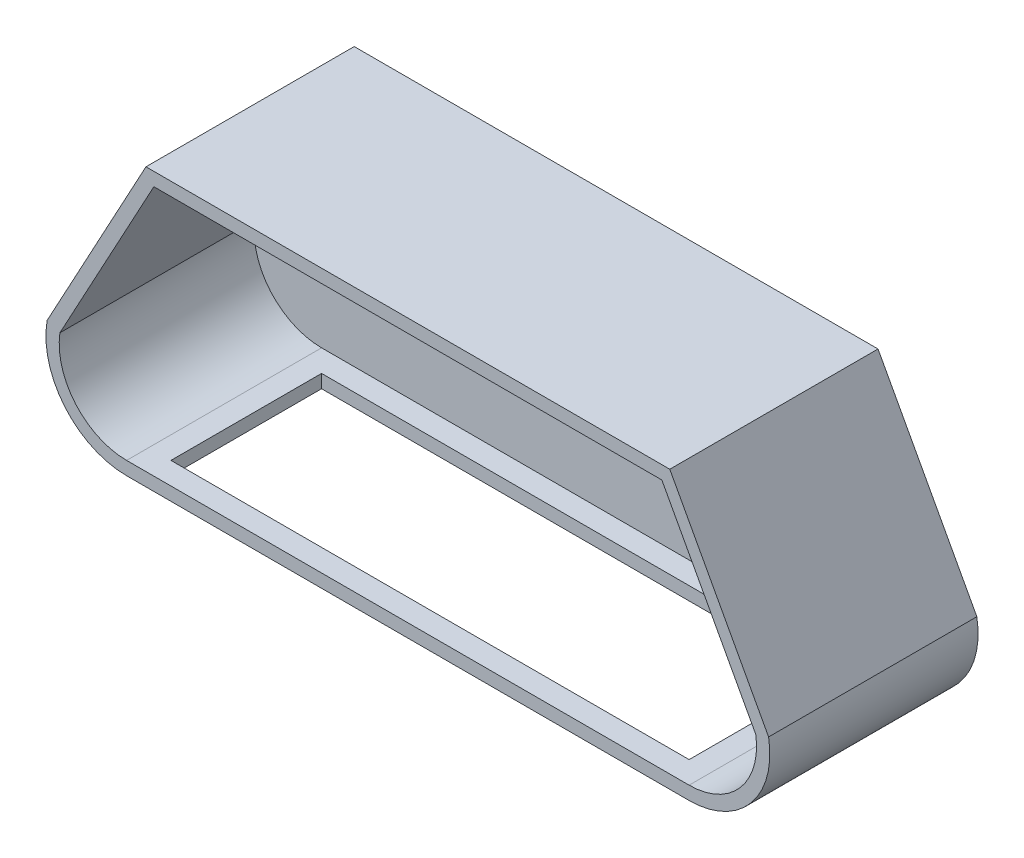
ISO-10303-21;
HEADER;
FILE_DESCRIPTION(('STEP AP214'),'2;1');
FILE_NAME('part.step','',(''),(''),'','','');
FILE_SCHEMA(('AUTOMOTIVE_DESIGN { 1 0 10303 214 1 1 1 1 }'));
ENDSEC;
DATA;
#1=APPLICATION_CONTEXT('core data for automotive mechanical design processes');
#2=APPLICATION_PROTOCOL_DEFINITION('international standard','automotive_design',2000,#1);
#3=PRODUCT_CONTEXT('',#1,'mechanical');
#4=PRODUCT('Part','Part','',(#3));
#5=PRODUCT_RELATED_PRODUCT_CATEGORY('part','',(#4));
#6=PRODUCT_DEFINITION_FORMATION('','',#4);
#7=PRODUCT_DEFINITION_CONTEXT('part definition',#1,'design');
#8=PRODUCT_DEFINITION('design','',#6,#7);
#9=PRODUCT_DEFINITION_SHAPE('','',#8);
#10=(LENGTH_UNIT() NAMED_UNIT(*) SI_UNIT(.MILLI.,.METRE.));
#11=(NAMED_UNIT(*) PLANE_ANGLE_UNIT() SI_UNIT($,.RADIAN.));
#12=(NAMED_UNIT(*) SI_UNIT($,.STERADIAN.) SOLID_ANGLE_UNIT());
#13=UNCERTAINTY_MEASURE_WITH_UNIT(LENGTH_MEASURE(1.E-05),#10,'distance_accuracy_value','');
#14=(GEOMETRIC_REPRESENTATION_CONTEXT(3) GLOBAL_UNCERTAINTY_ASSIGNED_CONTEXT((#13)) GLOBAL_UNIT_ASSIGNED_CONTEXT((#10,
#11,#12)) REPRESENTATION_CONTEXT('',''));
#15=CARTESIAN_POINT('',(0.,0.,0.));
#16=DIRECTION('',(0.,0.,1.));
#17=DIRECTION('',(1.,0.,0.));
#18=AXIS2_PLACEMENT_3D('',#15,#16,#17);
#19=CARTESIAN_POINT('',(0.,-61.,88.));
#20=DIRECTION('',(0.,-1.,0.));
#21=DIRECTION('',(1.,0.,0.));
#22=AXIS2_PLACEMENT_3D('',#19,#20,#21);
#23=PLANE('',#22);
#24=DIRECTION('',(0.,0.,-1.));
#25=VECTOR('',#24,1.);
#26=CARTESIAN_POINT('',(116.949501519958,-61.,0.));
#27=LINE('',#26,#25);
#28=CARTESIAN_POINT('',(116.949501519958,-61.,78.));
#29=VERTEX_POINT('',#28);
#30=CARTESIAN_POINT('',(116.949501519958,-61.,10.));
#31=VERTEX_POINT('',#30);
#32=EDGE_CURVE('E187',#29,#31,#27,.T.);
#33=ORIENTED_EDGE('',*,*,#32,.T.);
#34=DIRECTION('',(1.,0.,0.));
#35=VECTOR('',#34,1.);
#36=CARTESIAN_POINT('',(0.,-61.,10.));
#37=LINE('',#36,#35);
#38=CARTESIAN_POINT('',(-116.949501519958,-61.,10.));
#39=VERTEX_POINT('',#38);
#40=EDGE_CURVE('E191',#39,#31,#37,.T.);
#41=ORIENTED_EDGE('',*,*,#40,.F.);
#42=DIRECTION('',(0.,0.,-1.));
#43=VECTOR('',#42,1.);
#44=CARTESIAN_POINT('',(-116.949501519958,-61.,0.));
#45=LINE('',#44,#43);
#46=CARTESIAN_POINT('',(-116.949501519958,-61.,78.));
#47=VERTEX_POINT('',#46);
#48=EDGE_CURVE('E186',#47,#39,#45,.T.);
#49=ORIENTED_EDGE('',*,*,#48,.F.);
#50=DIRECTION('',(1.,0.,0.));
#51=VECTOR('',#50,1.);
#52=CARTESIAN_POINT('',(0.,-61.,78.));
#53=LINE('',#52,#51);
#54=EDGE_CURVE('E192',#47,#29,#53,.T.);
#55=ORIENTED_EDGE('',*,*,#54,.T.);
#56=EDGE_LOOP('',(#33,#41,#49,#55));
#57=FACE_BOUND('',#56,.T.);
#58=DIRECTION('',(0.,0.,-1.));
#59=VECTOR('',#58,1.);
#60=CARTESIAN_POINT('',(-126.949501519958,-61.,88.));
#61=LINE('',#60,#59);
#62=CARTESIAN_POINT('',(-126.949501519958,-61.,88.));
#63=VERTEX_POINT('',#62);
#64=CARTESIAN_POINT('',(-126.949501519958,-61.,-6.));
#65=VERTEX_POINT('',#64);
#66=EDGE_CURVE('E165',#63,#65,#61,.T.);
#67=ORIENTED_EDGE('',*,*,#66,.T.);
#68=DIRECTION('',(-1.,0.,0.));
#69=VECTOR('',#68,1.);
#70=CARTESIAN_POINT('',(0.,-61.,-6.));
#71=LINE('',#70,#69);
#72=CARTESIAN_POINT('',(126.949501519958,-61.,-6.));
#73=VERTEX_POINT('',#72);
#74=EDGE_CURVE('E164',#73,#65,#71,.T.);
#75=ORIENTED_EDGE('',*,*,#74,.F.);
#76=DIRECTION('',(0.,0.,-1.));
#77=VECTOR('',#76,1.);
#78=CARTESIAN_POINT('',(126.949501519958,-61.,88.));
#79=LINE('',#78,#77);
#80=CARTESIAN_POINT('',(126.949501519958,-61.,88.));
#81=VERTEX_POINT('',#80);
#82=EDGE_CURVE('E149',#81,#73,#79,.T.);
#83=ORIENTED_EDGE('',*,*,#82,.F.);
#84=DIRECTION('',(-1.,0.,0.));
#85=VECTOR('',#84,1.);
#86=CARTESIAN_POINT('',(0.,-61.,88.));
#87=LINE('',#86,#85);
#88=EDGE_CURVE('E221',#81,#63,#87,.T.);
#89=ORIENTED_EDGE('',*,*,#88,.T.);
#90=EDGE_LOOP('',(#67,#75,#83,#89));
#91=FACE_BOUND('',#90,.T.);
#92=ADVANCED_FACE('F37',(#57,#91),#23,.T.);
#93=CARTESIAN_POINT('',(126.949501519958,-24.5687329178451,88.));
#94=DIRECTION('',(0.,0.,-1.));
#95=DIRECTION('',(-1.,0.,0.));
#96=AXIS2_PLACEMENT_3D('',#93,#94,#95);
#97=CYLINDRICAL_SURFACE('',#96,36.4312670821549);
#98=ORIENTED_EDGE('',*,*,#82,.T.);
#99=CARTESIAN_POINT('',(126.949501519958,-24.5687329178451,-6.));
#100=DIRECTION('',(0.,0.,1.));
#101=DIRECTION('',(1.,0.,0.));
#102=AXIS2_PLACEMENT_3D('',#99,#100,#101);
#103=CIRCLE('',#102,36.4312670821549);
#104=CARTESIAN_POINT('',(162.822637658857,-18.2161488159757,-6.));
#105=VERTEX_POINT('',#104);
#106=EDGE_CURVE('E154',#73,#105,#103,.T.);
#107=ORIENTED_EDGE('',*,*,#106,.T.);
#108=DIRECTION('',(0.,0.,-1.));
#109=VECTOR('',#108,1.);
#110=CARTESIAN_POINT('',(162.822637658857,-18.2161488159757,88.));
#111=LINE('',#110,#109);
#112=CARTESIAN_POINT('',(162.822637658857,-18.2161488159757,88.));
#113=VERTEX_POINT('',#112);
#114=EDGE_CURVE('E161',#113,#105,#111,.T.);
#115=ORIENTED_EDGE('',*,*,#114,.F.);
#116=CARTESIAN_POINT('',(126.949501519958,-24.5687329178451,88.));
#117=DIRECTION('',(0.,0.,1.));
#118=DIRECTION('',(1.,0.,0.));
#119=AXIS2_PLACEMENT_3D('',#116,#117,#118);
#120=CIRCLE('',#119,36.4312670821549);
#121=EDGE_CURVE('E156',#81,#113,#120,.T.);
#122=ORIENTED_EDGE('',*,*,#121,.F.);
#123=EDGE_LOOP('',(#98,#107,#115,#122));
#124=FACE_BOUND('',#123,.T.);
#125=ADVANCED_FACE('F151',(#124),#97,.T.);
#126=CARTESIAN_POINT('',(118.258256189151,64.05655543579,88.));
#127=DIRECTION('',(-0.879291966536774,-0.476283148540753,0.));
#128=DIRECTION('',(0.476283148540753,-0.879291966536774,0.));
#129=AXIS2_PLACEMENT_3D('',#126,#127,#128);
#130=PLANE('',#129);
#131=ORIENTED_EDGE('',*,*,#114,.T.);
#132=DIRECTION('',(-0.476283148540752,0.879291966536774,0.));
#133=VECTOR('',#132,1.);
#134=CARTESIAN_POINT('',(118.258256189151,64.05655543579,-6.));
#135=LINE('',#134,#133);
#136=CARTESIAN_POINT('',(118.214818276398,64.1367485054865,-6.));
#137=VERTEX_POINT('',#136);
#138=EDGE_CURVE('E174',#105,#137,#135,.T.);
#139=ORIENTED_EDGE('',*,*,#138,.T.);
#140=DIRECTION('',(0.,0.,-1.));
#141=VECTOR('',#140,1.);
#142=CARTESIAN_POINT('',(118.214818276398,64.1367485054865,88.));
#143=LINE('',#142,#141);
#144=CARTESIAN_POINT('',(118.214818276398,64.1367485054865,88.));
#145=VERTEX_POINT('',#144);
#146=EDGE_CURVE('E255',#145,#137,#143,.T.);
#147=ORIENTED_EDGE('',*,*,#146,.F.);
#148=DIRECTION('',(-0.476283148540752,0.879291966536774,0.));
#149=VECTOR('',#148,1.);
#150=CARTESIAN_POINT('',(118.258256189151,64.05655543579,88.));
#151=LINE('',#150,#149);
#152=EDGE_CURVE('E224',#113,#145,#151,.T.);
#153=ORIENTED_EDGE('',*,*,#152,.F.);
#154=EDGE_LOOP('',(#131,#139,#147,#153));
#155=FACE_BOUND('',#154,.T.);
#156=ADVANCED_FACE('F299',(#155),#130,.F.);
#157=CARTESIAN_POINT('',(0.,64.1367485054865,88.));
#158=DIRECTION('',(0.,-1.,0.));
#159=DIRECTION('',(0.,0.,-1.));
#160=AXIS2_PLACEMENT_3D('',#157,#158,#159);
#161=PLANE('',#160);
#162=ORIENTED_EDGE('',*,*,#146,.T.);
#163=DIRECTION('',(-1.,0.,0.));
#164=VECTOR('',#163,1.);
#165=CARTESIAN_POINT('',(0.,64.1367485054865,-6.));
#166=LINE('',#165,#164);
#167=CARTESIAN_POINT('',(-118.214818276398,64.1367485054865,-6.));
#168=VERTEX_POINT('',#167);
#169=EDGE_CURVE('E176',#137,#168,#166,.T.);
#170=ORIENTED_EDGE('',*,*,#169,.T.);
#171=DIRECTION('',(0.,0.,-1.));
#172=VECTOR('',#171,1.);
#173=CARTESIAN_POINT('',(-118.214818276398,64.1367485054865,88.));
#174=LINE('',#173,#172);
#175=CARTESIAN_POINT('',(-118.214818276398,64.1367485054865,88.));
#176=VERTEX_POINT('',#175);
#177=EDGE_CURVE('E253',#176,#168,#174,.T.);
#178=ORIENTED_EDGE('',*,*,#177,.F.);
#179=DIRECTION('',(-1.,0.,0.));
#180=VECTOR('',#179,1.);
#181=CARTESIAN_POINT('',(0.,64.1367485054865,88.));
#182=LINE('',#181,#180);
#183=EDGE_CURVE('E227',#145,#176,#182,.T.);
#184=ORIENTED_EDGE('',*,*,#183,.F.);
#185=EDGE_LOOP('',(#162,#170,#178,#184));
#186=FACE_BOUND('',#185,.T.);
#187=ADVANCED_FACE('F328',(#186),#161,.F.);
#188=CARTESIAN_POINT('',(-118.258256189151,64.0565554357899,88.));
#189=DIRECTION('',(-0.879291966536774,0.476283148540752,0.));
#190=DIRECTION('',(-0.476283148540752,-0.879291966536774,0.));
#191=AXIS2_PLACEMENT_3D('',#188,#189,#190);
#192=PLANE('',#191);
#193=ORIENTED_EDGE('',*,*,#177,.T.);
#194=DIRECTION('',(0.476283148540752,0.879291966536774,0.));
#195=VECTOR('',#194,1.);
#196=CARTESIAN_POINT('',(-118.258256189151,64.0565554357899,-6.));
#197=LINE('',#196,#195);
#198=CARTESIAN_POINT('',(-162.822637658857,-18.2161488159757,-6.));
#199=VERTEX_POINT('',#198);
#200=EDGE_CURVE('E181',#199,#168,#197,.T.);
#201=ORIENTED_EDGE('',*,*,#200,.F.);
#202=DIRECTION('',(0.,0.,-1.));
#203=VECTOR('',#202,1.);
#204=CARTESIAN_POINT('',(-162.822637658857,-18.2161488159757,88.));
#205=LINE('',#204,#203);
#206=CARTESIAN_POINT('',(-162.822637658857,-18.2161488159757,88.));
#207=VERTEX_POINT('',#206);
#208=EDGE_CURVE('E250',#207,#199,#205,.T.);
#209=ORIENTED_EDGE('',*,*,#208,.F.);
#210=DIRECTION('',(0.476283148540752,0.879291966536774,0.));
#211=VECTOR('',#210,1.);
#212=CARTESIAN_POINT('',(-118.258256189151,64.0565554357899,88.));
#213=LINE('',#212,#211);
#214=EDGE_CURVE('E229',#207,#176,#213,.T.);
#215=ORIENTED_EDGE('',*,*,#214,.T.);
#216=EDGE_LOOP('',(#193,#201,#209,#215));
#217=FACE_BOUND('',#216,.T.);
#218=ADVANCED_FACE('F323',(#217),#192,.T.);
#219=CARTESIAN_POINT('',(126.949501519958,-24.5687329178451,88.));
#220=DIRECTION('',(0.,0.,-1.));
#221=DIRECTION('',(-1.,0.,0.));
#222=AXIS2_PLACEMENT_3D('',#219,#220,#221);
#223=CYLINDRICAL_SURFACE('',#222,30.4312670821549);
#224=CARTESIAN_POINT('',(126.949501519958,-24.5687329178451,0.));
#225=DIRECTION('',(0.,0.,1.));
#226=DIRECTION('',(1.,0.,0.));
#227=AXIS2_PLACEMENT_3D('',#224,#225,#226);
#228=CIRCLE('',#227,30.4312670821549);
#229=CARTESIAN_POINT('',(126.949501519958,-55.,0.));
#230=VERTEX_POINT('',#229);
#231=CARTESIAN_POINT('',(157.062609578427,-20.1797991880649,0.));
#232=VERTEX_POINT('',#231);
#233=EDGE_CURVE('E204',#230,#232,#228,.T.);
#234=ORIENTED_EDGE('',*,*,#233,.F.);
#235=DIRECTION('',(0.,0.,-1.));
#236=VECTOR('',#235,1.);
#237=CARTESIAN_POINT('',(126.949501519958,-55.,88.));
#238=LINE('',#237,#236);
#239=CARTESIAN_POINT('',(126.949501519958,-55.,88.));
#240=VERTEX_POINT('',#239);
#241=EDGE_CURVE('E251',#240,#230,#238,.T.);
#242=ORIENTED_EDGE('',*,*,#241,.F.);
#243=CARTESIAN_POINT('',(126.949501519958,-24.5687329178451,88.));
#244=DIRECTION('',(0.,0.,1.));
#245=DIRECTION('',(1.,0.,0.));
#246=AXIS2_PLACEMENT_3D('',#243,#244,#245);
#247=CIRCLE('',#246,30.4312670821549);
#248=CARTESIAN_POINT('',(157.062609578427,-20.1797991880649,88.));
#249=VERTEX_POINT('',#248);
#250=EDGE_CURVE('E205',#240,#249,#247,.T.);
#251=ORIENTED_EDGE('',*,*,#250,.T.);
#252=DIRECTION('',(0.,0.,-1.));
#253=VECTOR('',#252,1.);
#254=CARTESIAN_POINT('',(157.062609578427,-20.1797991880649,88.));
#255=LINE('',#254,#253);
#256=EDGE_CURVE('E235',#249,#232,#255,.T.);
#257=ORIENTED_EDGE('',*,*,#256,.T.);
#258=EDGE_LOOP('',(#234,#242,#251,#257));
#259=FACE_BOUND('',#258,.T.);
#260=ADVANCED_FACE('F39',(#259),#223,.F.);
#261=CARTESIAN_POINT('',(0.,-55.,88.));
#262=DIRECTION('',(0.,-1.,0.));
#263=DIRECTION('',(1.,0.,0.));
#264=AXIS2_PLACEMENT_3D('',#261,#262,#263);
#265=PLANE('',#264);
#266=DIRECTION('',(-1.,0.,0.));
#267=VECTOR('',#266,1.);
#268=CARTESIAN_POINT('',(0.,-55.,9.99999999999999));
#269=LINE('',#268,#267);
#270=CARTESIAN_POINT('',(116.949501519958,-55.,10.));
#271=VERTEX_POINT('',#270);
#272=CARTESIAN_POINT('',(-116.949501519958,-55.,9.99999999999999));
#273=VERTEX_POINT('',#272);
#274=EDGE_CURVE('E45',#271,#273,#269,.T.);
#275=ORIENTED_EDGE('',*,*,#274,.F.);
#276=DIRECTION('',(0.,0.,1.));
#277=VECTOR('',#276,1.);
#278=CARTESIAN_POINT('',(116.949501519958,-55.,88.));
#279=LINE('',#278,#277);
#280=CARTESIAN_POINT('',(116.949501519958,-55.,78.));
#281=VERTEX_POINT('',#280);
#282=EDGE_CURVE('E11',#271,#281,#279,.T.);
#283=ORIENTED_EDGE('',*,*,#282,.T.);
#284=DIRECTION('',(-1.,0.,0.));
#285=VECTOR('',#284,1.);
#286=CARTESIAN_POINT('',(0.,-55.,78.));
#287=LINE('',#286,#285);
#288=CARTESIAN_POINT('',(-116.949501519958,-55.,78.));
#289=VERTEX_POINT('',#288);
#290=EDGE_CURVE('E160',#281,#289,#287,.T.);
#291=ORIENTED_EDGE('',*,*,#290,.T.);
#292=DIRECTION('',(0.,0.,1.));
#293=VECTOR('',#292,1.);
#294=CARTESIAN_POINT('',(-116.949501519958,-55.,88.));
#295=LINE('',#294,#293);
#296=EDGE_CURVE('E276',#273,#289,#295,.T.);
#297=ORIENTED_EDGE('',*,*,#296,.F.);
#298=EDGE_LOOP('',(#275,#283,#291,#297));
#299=FACE_BOUND('',#298,.T.);
#300=DIRECTION('',(-1.,0.,0.));
#301=VECTOR('',#300,1.);
#302=CARTESIAN_POINT('',(0.,-55.,0.));
#303=LINE('',#302,#301);
#304=CARTESIAN_POINT('',(-126.949501519958,-55.,0.));
#305=VERTEX_POINT('',#304);
#306=EDGE_CURVE('E237',#230,#305,#303,.T.);
#307=ORIENTED_EDGE('',*,*,#306,.T.);
#308=DIRECTION('',(0.,0.,-1.));
#309=VECTOR('',#308,1.);
#310=CARTESIAN_POINT('',(-126.949501519958,-55.,88.));
#311=LINE('',#310,#309);
#312=CARTESIAN_POINT('',(-126.949501519958,-55.,88.));
#313=VERTEX_POINT('',#312);
#314=EDGE_CURVE('E269',#313,#305,#311,.T.);
#315=ORIENTED_EDGE('',*,*,#314,.F.);
#316=DIRECTION('',(-1.,0.,0.));
#317=VECTOR('',#316,1.);
#318=CARTESIAN_POINT('',(0.,-55.,88.));
#319=LINE('',#318,#317);
#320=EDGE_CURVE('E208',#240,#313,#319,.T.);
#321=ORIENTED_EDGE('',*,*,#320,.F.);
#322=ORIENTED_EDGE('',*,*,#241,.T.);
#323=EDGE_LOOP('',(#307,#315,#321,#322));
#324=FACE_BOUND('',#323,.T.);
#325=ADVANCED_FACE('F288',(#299,#324),#265,.F.);
#326=CARTESIAN_POINT('',(-126.949501519958,-24.5687329178451,88.));
#327=DIRECTION('',(0.,0.,-1.));
#328=DIRECTION('',(-1.,0.,0.));
#329=AXIS2_PLACEMENT_3D('',#326,#327,#328);
#330=CYLINDRICAL_SURFACE('',#329,30.4312670821549);
#331=CARTESIAN_POINT('',(-126.949501519958,-24.5687329178451,0.));
#332=DIRECTION('',(0.,0.,1.));
#333=DIRECTION('',(1.,0.,0.));
#334=AXIS2_PLACEMENT_3D('',#331,#332,#333);
#335=CIRCLE('',#334,30.4312670821549);
#336=CARTESIAN_POINT('',(-157.062609578427,-20.1797991880649,0.));
#337=VERTEX_POINT('',#336);
#338=EDGE_CURVE('E240',#305,#337,#335,.F.);
#339=ORIENTED_EDGE('',*,*,#338,.T.);
#340=DIRECTION('',(0.,0.,-1.));
#341=VECTOR('',#340,1.);
#342=CARTESIAN_POINT('',(-157.062609578427,-20.1797991880649,88.));
#343=LINE('',#342,#341);
#344=CARTESIAN_POINT('',(-157.062609578427,-20.1797991880649,88.));
#345=VERTEX_POINT('',#344);
#346=EDGE_CURVE('E266',#345,#337,#343,.T.);
#347=ORIENTED_EDGE('',*,*,#346,.F.);
#348=CARTESIAN_POINT('',(-126.949501519958,-24.5687329178451,88.));
#349=DIRECTION('',(0.,0.,1.));
#350=DIRECTION('',(1.,0.,0.));
#351=AXIS2_PLACEMENT_3D('',#348,#349,#350);
#352=CIRCLE('',#351,30.4312670821549);
#353=EDGE_CURVE('E211',#313,#345,#352,.F.);
#354=ORIENTED_EDGE('',*,*,#353,.F.);
#355=ORIENTED_EDGE('',*,*,#314,.T.);
#356=EDGE_LOOP('',(#339,#347,#354,#355));
#357=FACE_BOUND('',#356,.T.);
#358=ADVANCED_FACE('F315',(#357),#330,.F.);
#359=CARTESIAN_POINT('',(-112.98250438993,61.1988565445455,88.));
#360=DIRECTION('',(-0.879291966536774,0.476283148540753,0.));
#361=DIRECTION('',(-0.476283148540753,-0.879291966536774,0.));
#362=AXIS2_PLACEMENT_3D('',#359,#360,#361);
#363=PLANE('',#362);
#364=DIRECTION('',(0.476283148540753,0.879291966536774,0.));
#365=VECTOR('',#364,1.);
#366=CARTESIAN_POINT('',(-112.98250438993,61.1988565445455,0.));
#367=LINE('',#366,#365);
#368=CARTESIAN_POINT('',(-114.64114624442,58.1367485054865,0.));
#369=VERTEX_POINT('',#368);
#370=EDGE_CURVE('E243',#337,#369,#367,.T.);
#371=ORIENTED_EDGE('',*,*,#370,.T.);
#372=DIRECTION('',(0.,0.,-1.));
#373=VECTOR('',#372,1.);
#374=CARTESIAN_POINT('',(-114.64114624442,58.1367485054865,88.));
#375=LINE('',#374,#373);
#376=CARTESIAN_POINT('',(-114.64114624442,58.1367485054865,88.));
#377=VERTEX_POINT('',#376);
#378=EDGE_CURVE('E263',#377,#369,#375,.T.);
#379=ORIENTED_EDGE('',*,*,#378,.F.);
#380=DIRECTION('',(0.476283148540753,0.879291966536774,0.));
#381=VECTOR('',#380,1.);
#382=CARTESIAN_POINT('',(-112.98250438993,61.1988565445455,88.));
#383=LINE('',#382,#381);
#384=EDGE_CURVE('E213',#345,#377,#383,.T.);
#385=ORIENTED_EDGE('',*,*,#384,.F.);
#386=ORIENTED_EDGE('',*,*,#346,.T.);
#387=EDGE_LOOP('',(#371,#379,#385,#386));
#388=FACE_BOUND('',#387,.T.);
#389=ADVANCED_FACE('F311',(#388),#363,.F.);
#390=CARTESIAN_POINT('',(0.,58.1367485054865,88.));
#391=DIRECTION('',(0.,-1.,0.));
#392=DIRECTION('',(1.,0.,0.));
#393=AXIS2_PLACEMENT_3D('',#390,#391,#392);
#394=PLANE('',#393);
#395=DIRECTION('',(-1.,0.,0.));
#396=VECTOR('',#395,1.);
#397=CARTESIAN_POINT('',(0.,58.1367485054865,0.));
#398=LINE('',#397,#396);
#399=CARTESIAN_POINT('',(114.64114624442,58.1367485054865,0.));
#400=VERTEX_POINT('',#399);
#401=EDGE_CURVE('E246',#400,#369,#398,.T.);
#402=ORIENTED_EDGE('',*,*,#401,.F.);
#403=DIRECTION('',(0.,0.,-1.));
#404=VECTOR('',#403,1.);
#405=CARTESIAN_POINT('',(114.64114624442,58.1367485054865,88.));
#406=LINE('',#405,#404);
#407=CARTESIAN_POINT('',(114.64114624442,58.1367485054865,88.));
#408=VERTEX_POINT('',#407);
#409=EDGE_CURVE('E260',#408,#400,#406,.T.);
#410=ORIENTED_EDGE('',*,*,#409,.F.);
#411=DIRECTION('',(-1.,0.,0.));
#412=VECTOR('',#411,1.);
#413=CARTESIAN_POINT('',(0.,58.1367485054865,88.));
#414=LINE('',#413,#412);
#415=EDGE_CURVE('E215',#408,#377,#414,.T.);
#416=ORIENTED_EDGE('',*,*,#415,.T.);
#417=ORIENTED_EDGE('',*,*,#378,.T.);
#418=EDGE_LOOP('',(#402,#410,#416,#417));
#419=FACE_BOUND('',#418,.T.);
#420=ADVANCED_FACE('F307',(#419),#394,.T.);
#421=CARTESIAN_POINT('',(112.98250438993,61.1988565445455,88.));
#422=DIRECTION('',(-0.879291966536774,-0.476283148540753,0.));
#423=DIRECTION('',(0.476283148540753,-0.879291966536774,0.));
#424=AXIS2_PLACEMENT_3D('',#421,#422,#423);
#425=PLANE('',#424);
#426=DIRECTION('',(-0.476283148540753,0.879291966536774,0.));
#427=VECTOR('',#426,1.);
#428=CARTESIAN_POINT('',(112.98250438993,61.1988565445455,0.));
#429=LINE('',#428,#427);
#430=EDGE_CURVE('E209',#232,#400,#429,.T.);
#431=ORIENTED_EDGE('',*,*,#430,.F.);
#432=ORIENTED_EDGE('',*,*,#256,.F.);
#433=DIRECTION('',(-0.476283148540753,0.879291966536774,0.));
#434=VECTOR('',#433,1.);
#435=CARTESIAN_POINT('',(112.98250438993,61.1988565445455,88.));
#436=LINE('',#435,#434);
#437=EDGE_CURVE('E218',#249,#408,#436,.T.);
#438=ORIENTED_EDGE('',*,*,#437,.T.);
#439=ORIENTED_EDGE('',*,*,#409,.T.);
#440=EDGE_LOOP('',(#431,#432,#438,#439));
#441=FACE_BOUND('',#440,.T.);
#442=ADVANCED_FACE('F303',(#441),#425,.T.);
#443=CARTESIAN_POINT('',(-126.949501519958,-24.5687329178451,88.));
#444=DIRECTION('',(0.,0.,-1.));
#445=DIRECTION('',(-1.,0.,0.));
#446=AXIS2_PLACEMENT_3D('',#443,#444,#445);
#447=CYLINDRICAL_SURFACE('',#446,36.4312670821549);
#448=ORIENTED_EDGE('',*,*,#208,.T.);
#449=CARTESIAN_POINT('',(-126.949501519958,-24.5687329178451,-6.));
#450=DIRECTION('',(0.,0.,1.));
#451=DIRECTION('',(1.,0.,0.));
#452=AXIS2_PLACEMENT_3D('',#449,#450,#451);
#453=CIRCLE('',#452,36.4312670821549);
#454=EDGE_CURVE('E184',#65,#199,#453,.F.);
#455=ORIENTED_EDGE('',*,*,#454,.F.);
#456=ORIENTED_EDGE('',*,*,#66,.F.);
#457=CARTESIAN_POINT('',(-126.949501519958,-24.5687329178451,88.));
#458=DIRECTION('',(0.,0.,1.));
#459=DIRECTION('',(1.,0.,0.));
#460=AXIS2_PLACEMENT_3D('',#457,#458,#459);
#461=CIRCLE('',#460,36.4312670821549);
#462=EDGE_CURVE('E232',#63,#207,#461,.F.);
#463=ORIENTED_EDGE('',*,*,#462,.T.);
#464=EDGE_LOOP('',(#448,#455,#456,#463));
#465=FACE_BOUND('',#464,.T.);
#466=ADVANCED_FACE('F306',(#465),#447,.T.);
#467=CARTESIAN_POINT('',(0.,0.,88.));
#468=DIRECTION('',(0.,0.,1.));
#469=DIRECTION('',(1.,0.,0.));
#470=AXIS2_PLACEMENT_3D('',#467,#468,#469);
#471=PLANE('',#470);
#472=ORIENTED_EDGE('',*,*,#250,.F.);
#473=ORIENTED_EDGE('',*,*,#320,.T.);
#474=ORIENTED_EDGE('',*,*,#353,.T.);
#475=ORIENTED_EDGE('',*,*,#384,.T.);
#476=ORIENTED_EDGE('',*,*,#415,.F.);
#477=ORIENTED_EDGE('',*,*,#437,.F.);
#478=EDGE_LOOP('',(#472,#473,#474,#475,#476,#477));
#479=FACE_BOUND('',#478,.T.);
#480=ORIENTED_EDGE('',*,*,#88,.F.);
#481=ORIENTED_EDGE('',*,*,#121,.T.);
#482=ORIENTED_EDGE('',*,*,#152,.T.);
#483=ORIENTED_EDGE('',*,*,#183,.T.);
#484=ORIENTED_EDGE('',*,*,#214,.F.);
#485=ORIENTED_EDGE('',*,*,#462,.F.);
#486=EDGE_LOOP('',(#480,#481,#482,#483,#484,#485));
#487=FACE_BOUND('',#486,.T.);
#488=ADVANCED_FACE('F341',(#479,#487),#471,.T.);
#489=CARTESIAN_POINT('',(116.949501519958,-304.583134931519,0.));
#490=DIRECTION('',(1.,0.,0.));
#491=DIRECTION('',(0.,0.,-1.));
#492=AXIS2_PLACEMENT_3D('',#489,#490,#491);
#493=PLANE('',#492);
#494=DIRECTION('',(0.,1.,0.));
#495=VECTOR('',#494,1.);
#496=CARTESIAN_POINT('',(116.949501519958,-304.583134931519,10.));
#497=LINE('',#496,#495);
#498=EDGE_CURVE('E190',#31,#271,#497,.T.);
#499=ORIENTED_EDGE('',*,*,#498,.F.);
#500=ORIENTED_EDGE('',*,*,#32,.F.);
#501=DIRECTION('',(0.,1.,0.));
#502=VECTOR('',#501,1.);
#503=CARTESIAN_POINT('',(116.949501519958,-304.583134931519,78.));
#504=LINE('',#503,#502);
#505=EDGE_CURVE('E52',#29,#281,#504,.T.);
#506=ORIENTED_EDGE('',*,*,#505,.T.);
#507=ORIENTED_EDGE('',*,*,#282,.F.);
#508=EDGE_LOOP('',(#499,#500,#506,#507));
#509=FACE_BOUND('',#508,.T.);
#510=ADVANCED_FACE('F292',(#509),#493,.F.);
#511=CARTESIAN_POINT('',(0.,-304.583134931519,10.));
#512=DIRECTION('',(0.,0.,1.));
#513=DIRECTION('',(1.,0.,0.));
#514=AXIS2_PLACEMENT_3D('',#511,#512,#513);
#515=PLANE('',#514);
#516=ORIENTED_EDGE('',*,*,#274,.T.);
#517=DIRECTION('',(0.,1.,0.));
#518=VECTOR('',#517,1.);
#519=CARTESIAN_POINT('',(-116.949501519958,-304.583134931519,9.99999999999999));
#520=LINE('',#519,#518);
#521=EDGE_CURVE('E198',#39,#273,#520,.T.);
#522=ORIENTED_EDGE('',*,*,#521,.F.);
#523=ORIENTED_EDGE('',*,*,#40,.T.);
#524=ORIENTED_EDGE('',*,*,#498,.T.);
#525=EDGE_LOOP('',(#516,#522,#523,#524));
#526=FACE_BOUND('',#525,.T.);
#527=ADVANCED_FACE('F280',(#526),#515,.T.);
#528=CARTESIAN_POINT('',(-116.949501519958,-304.583134931519,0.));
#529=DIRECTION('',(1.,0.,0.));
#530=DIRECTION('',(0.,0.,-1.));
#531=AXIS2_PLACEMENT_3D('',#528,#529,#530);
#532=PLANE('',#531);
#533=ORIENTED_EDGE('',*,*,#296,.T.);
#534=DIRECTION('',(0.,1.,0.));
#535=VECTOR('',#534,1.);
#536=CARTESIAN_POINT('',(-116.949501519958,-304.583134931519,78.));
#537=LINE('',#536,#535);
#538=EDGE_CURVE('E57',#47,#289,#537,.T.);
#539=ORIENTED_EDGE('',*,*,#538,.F.);
#540=ORIENTED_EDGE('',*,*,#48,.T.);
#541=ORIENTED_EDGE('',*,*,#521,.T.);
#542=EDGE_LOOP('',(#533,#539,#540,#541));
#543=FACE_BOUND('',#542,.T.);
#544=ADVANCED_FACE('F286',(#543),#532,.T.);
#545=CARTESIAN_POINT('',(0.,-304.583134931519,78.));
#546=DIRECTION('',(0.,0.,1.));
#547=DIRECTION('',(1.,0.,0.));
#548=AXIS2_PLACEMENT_3D('',#545,#546,#547);
#549=PLANE('',#548);
#550=ORIENTED_EDGE('',*,*,#505,.F.);
#551=ORIENTED_EDGE('',*,*,#54,.F.);
#552=ORIENTED_EDGE('',*,*,#538,.T.);
#553=ORIENTED_EDGE('',*,*,#290,.F.);
#554=EDGE_LOOP('',(#550,#551,#552,#553));
#555=FACE_BOUND('',#554,.T.);
#556=ADVANCED_FACE('F290',(#555),#549,.F.);
#557=CARTESIAN_POINT('',(0.,0.,0.));
#558=DIRECTION('',(0.,0.,1.));
#559=DIRECTION('',(1.,0.,0.));
#560=AXIS2_PLACEMENT_3D('',#557,#558,#559);
#561=PLANE('',#560);
#562=ORIENTED_EDGE('',*,*,#306,.F.);
#563=ORIENTED_EDGE('',*,*,#233,.T.);
#564=ORIENTED_EDGE('',*,*,#430,.T.);
#565=ORIENTED_EDGE('',*,*,#401,.T.);
#566=ORIENTED_EDGE('',*,*,#370,.F.);
#567=ORIENTED_EDGE('',*,*,#338,.F.);
#568=EDGE_LOOP('',(#562,#563,#564,#565,#566,#567));
#569=FACE_BOUND('',#568,.T.);
#570=ADVANCED_FACE('F335',(#569),#561,.T.);
#571=CARTESIAN_POINT('',(0.,0.,-6.));
#572=DIRECTION('',(0.,0.,1.));
#573=DIRECTION('',(1.,0.,0.));
#574=AXIS2_PLACEMENT_3D('',#571,#572,#573);
#575=PLANE('',#574);
#576=ORIENTED_EDGE('',*,*,#74,.T.);
#577=ORIENTED_EDGE('',*,*,#454,.T.);
#578=ORIENTED_EDGE('',*,*,#200,.T.);
#579=ORIENTED_EDGE('',*,*,#169,.F.);
#580=ORIENTED_EDGE('',*,*,#138,.F.);
#581=ORIENTED_EDGE('',*,*,#106,.F.);
#582=EDGE_LOOP('',(#576,#577,#578,#579,#580,#581));
#583=FACE_BOUND('',#582,.T.);
#584=ADVANCED_FACE('F171',(#583),#575,.F.);
#585=CLOSED_SHELL('',(#92,#125,#156,#187,#218,#260,#325,#358,#389,#420,#442,#466,#488,#510,#527,
#544,#556,#570,#584));
#586=MANIFOLD_SOLID_BREP('B2',#585);
#587=ADVANCED_BREP_SHAPE_REPRESENTATION('',(#18,#586),#14);
#588=SHAPE_DEFINITION_REPRESENTATION(#9,#587);
ENDSEC;
END-ISO-10303-21;
